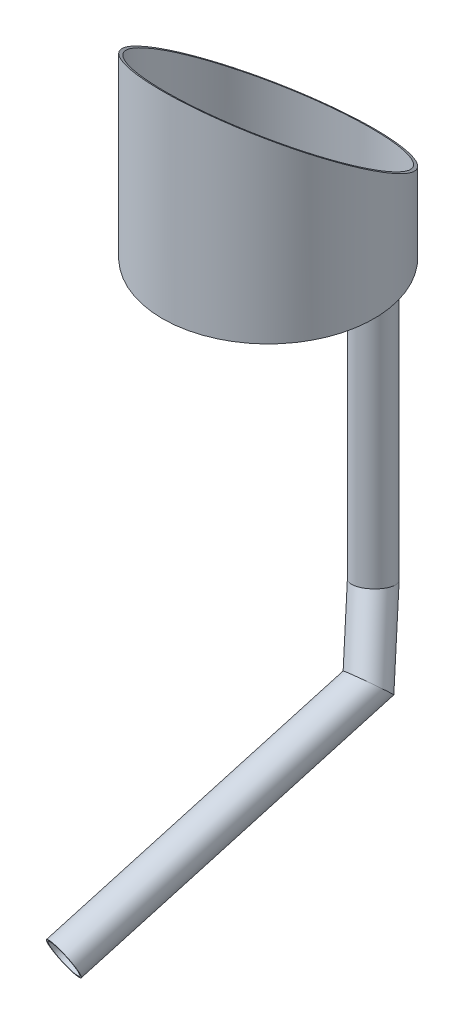
ISO-10303-21;
HEADER;
FILE_DESCRIPTION(('STEP AP214'),'2;1');
FILE_NAME('part.step','',(''),(''),'','','');
FILE_SCHEMA(('AUTOMOTIVE_DESIGN { 1 0 10303 214 1 1 1 1 }'));
ENDSEC;
DATA;
#1=APPLICATION_CONTEXT('core data for automotive mechanical design processes');
#2=APPLICATION_PROTOCOL_DEFINITION('international standard','automotive_design',2000,#1);
#3=PRODUCT_CONTEXT('',#1,'mechanical');
#4=PRODUCT('Part','Part','',(#3));
#5=PRODUCT_RELATED_PRODUCT_CATEGORY('part','',(#4));
#6=PRODUCT_DEFINITION_FORMATION('','',#4);
#7=PRODUCT_DEFINITION_CONTEXT('part definition',#1,'design');
#8=PRODUCT_DEFINITION('design','',#6,#7);
#9=PRODUCT_DEFINITION_SHAPE('','',#8);
#10=(LENGTH_UNIT() NAMED_UNIT(*) SI_UNIT(.MILLI.,.METRE.));
#11=(NAMED_UNIT(*) PLANE_ANGLE_UNIT() SI_UNIT($,.RADIAN.));
#12=(NAMED_UNIT(*) SI_UNIT($,.STERADIAN.) SOLID_ANGLE_UNIT());
#13=UNCERTAINTY_MEASURE_WITH_UNIT(LENGTH_MEASURE(1.E-05),#10,'distance_accuracy_value','');
#14=(GEOMETRIC_REPRESENTATION_CONTEXT(3) GLOBAL_UNCERTAINTY_ASSIGNED_CONTEXT((#13)) GLOBAL_UNIT_ASSIGNED_CONTEXT((#10,
#11,#12)) REPRESENTATION_CONTEXT('',''));
#15=CARTESIAN_POINT('',(0.,0.,0.));
#16=DIRECTION('',(0.,0.,1.));
#17=DIRECTION('',(1.,0.,0.));
#18=AXIS2_PLACEMENT_3D('',#15,#16,#17);
#19=CARTESIAN_POINT('',(40.0000000000001,-304.8,-69.2820323027551));
#20=DIRECTION('',(0.,1.,0.));
#21=DIRECTION('',(0.,0.,1.));
#22=AXIS2_PLACEMENT_3D('',#19,#20,#21);
#23=CYLINDRICAL_SURFACE('',#22,17.399);
#24=CARTESIAN_POINT('',(40.0000000000001,0.,-69.2820323027551));
#25=DIRECTION('',(0.,-1.,0.));
#26=DIRECTION('',(0.,0.,-1.));
#27=AXIS2_PLACEMENT_3D('',#24,#25,#26);
#28=CIRCLE('',#27,17.399);
#29=CARTESIAN_POINT('',(40.0000000000001,0.,-86.681032302755));
#30=VERTEX_POINT('',#29);
#31=EDGE_CURVE('E65',#30,#30,#28,.T.);
#32=ORIENTED_EDGE('',*,*,#31,.F.);
#33=EDGE_LOOP('',(#32));
#34=FACE_BOUND('',#33,.T.);
#35=CARTESIAN_POINT('',(40.0000000000001,-304.8,-69.2820323027551));
#36=DIRECTION('',(0.168834182634602,-0.964595100910073,0.202611228895122));
#37=DIRECTION('',(0.61750037075505,0.263735267456375,0.741037786362538));
#38=AXIS2_PLACEMENT_3D('',#35,#36,#37);
#39=ELLIPSE('',#38,18.0376201201773,17.399);
#40=CARTESIAN_POINT('',(51.1382371117483,-300.042843433329,-55.9154742176505));
#41=VERTEX_POINT('',#40);
#42=EDGE_CURVE('E61',#41,#41,#39,.T.);
#43=ORIENTED_EDGE('',*,*,#42,.T.);
#44=EDGE_LOOP('',(#43));
#45=FACE_BOUND('',#44,.T.);
#46=ADVANCED_FACE('F57',(#34,#45),#23,.F.);
#47=CARTESIAN_POINT('',(40.0000000000001,-304.8,-69.2820323027551));
#48=DIRECTION('',(0.,1.,0.));
#49=DIRECTION('',(0.,0.,1.));
#50=AXIS2_PLACEMENT_3D('',#47,#48,#49);
#51=CYLINDRICAL_SURFACE('',#50,19.05);
#52=CARTESIAN_POINT('',(40.0000000000001,0.,-69.2820323027551));
#53=DIRECTION('',(0.,-1.,0.));
#54=DIRECTION('',(0.,0.,-1.));
#55=AXIS2_PLACEMENT_3D('',#52,#53,#54);
#56=CIRCLE('',#55,19.05);
#57=CARTESIAN_POINT('',(40.0000000000001,0.,-88.3320323027551));
#58=VERTEX_POINT('',#57);
#59=EDGE_CURVE('E69',#58,#58,#56,.T.);
#60=ORIENTED_EDGE('',*,*,#59,.T.);
#61=EDGE_LOOP('',(#60));
#62=FACE_BOUND('',#61,.T.);
#63=CARTESIAN_POINT('',(40.0000000000001,-304.8,-69.2820323027551));
#64=DIRECTION('',(0.168834182634602,-0.964595100910073,0.202611228895122));
#65=DIRECTION('',(0.61750037075505,0.263735267456375,0.741037786362538));
#66=AXIS2_PLACEMENT_3D('',#63,#64,#65);
#67=ELLIPSE('',#66,19.7492191096832,19.05);
#68=CARTESIAN_POINT('',(52.1951501223522,-299.591434416053,-54.6471146913267));
#69=VERTEX_POINT('',#68);
#70=EDGE_CURVE('E12',#69,#69,#67,.T.);
#71=ORIENTED_EDGE('',*,*,#70,.F.);
#72=EDGE_LOOP('',(#71));
#73=FACE_BOUND('',#72,.T.);
#74=ADVANCED_FACE('F84',(#62,#73),#51,.T.);
#75=CARTESIAN_POINT('',(40.0000000000001,0.,-69.2820323027551));
#76=DIRECTION('',(0.,-1.,0.));
#77=DIRECTION('',(0.,0.,-1.));
#78=AXIS2_PLACEMENT_3D('',#75,#76,#77);
#79=PLANE('',#78);
#80=ORIENTED_EDGE('',*,*,#31,.T.);
#81=EDGE_LOOP('',(#80));
#82=FACE_BOUND('',#81,.T.);
#83=ORIENTED_EDGE('',*,*,#59,.F.);
#84=EDGE_LOOP('',(#83));
#85=FACE_BOUND('',#84,.T.);
#86=ADVANCED_FACE('F80',(#82,#85),#79,.F.);
#87=CARTESIAN_POINT('',(40.0000000000001,-304.8,-69.2820323027551));
#88=DIRECTION('',(0.168834182634602,-0.964595100910073,0.202611228895122));
#89=DIRECTION('',(0.,-0.205562183240805,-0.978644056243777));
#90=AXIS2_PLACEMENT_3D('',#87,#88,#89);
#91=PLANE('',#90);
#92=ORIENTED_EDGE('',*,*,#42,.F.);
#93=EDGE_LOOP('',(#92));
#94=FACE_BOUND('',#93,.T.);
#95=ORIENTED_EDGE('',*,*,#70,.T.);
#96=EDGE_LOOP('',(#95));
#97=FACE_BOUND('',#96,.T.);
#98=ADVANCED_FACE('F59',(#94,#97),#91,.T.);
#99=CLOSED_SHELL('',(#46,#74,#86,#98));
#100=MANIFOLD_SOLID_BREP('B2',#99);
#101=CARTESIAN_POINT('',(64.8193497163694,-370.399621205836,-39.4973117684385));
#102=DIRECTION('',(-0.325713250870988,0.860887417399428,-0.390875597563209));
#103=DIRECTION('',(0.,0.413419966091828,0.910540461284742));
#104=AXIS2_PLACEMENT_3D('',#101,#102,#103);
#105=CYLINDRICAL_SURFACE('',#104,17.399);
#106=CARTESIAN_POINT('',(64.8193497163694,-370.399621205836,-39.4973117684385));
#107=DIRECTION('',(0.0828203891155354,-0.724240374652722,0.684555814283712));
#108=DIRECTION('',(-0.629735906835058,0.49435653646272,0.599203056149758));
#109=AXIS2_PLACEMENT_3D('',#106,#107,#108);
#110=ELLIPSE('',#109,18.9523066652852,17.399);
#111=CARTESIAN_POINT('',(52.8844016918899,-361.030424524807,-28.1410316935122));
#112=VERTEX_POINT('',#111);
#113=EDGE_CURVE('E171',#112,#112,#110,.T.);
#114=ORIENTED_EDGE('',*,*,#113,.T.);
#115=EDGE_LOOP('',(#114));
#116=FACE_BOUND('',#115,.T.);
#117=CARTESIAN_POINT('',(40.0000000000001,-304.8,-69.2820323027551));
#118=DIRECTION('',(-0.168834182634602,0.964595100910073,-0.202611228895122));
#119=DIRECTION('',(-0.61750037075505,-0.263735267456376,-0.741037786362537));
#120=AXIS2_PLACEMENT_3D('',#117,#118,#119);
#121=ELLIPSE('',#120,18.0376201201773,17.399);
#122=CARTESIAN_POINT('',(28.8617628882519,-309.557156566671,-82.6485903878596));
#123=VERTEX_POINT('',#122);
#124=EDGE_CURVE('E161',#123,#123,#121,.T.);
#125=ORIENTED_EDGE('',*,*,#124,.T.);
#126=EDGE_LOOP('',(#125));
#127=FACE_BOUND('',#126,.T.);
#128=ADVANCED_FACE('F157',(#116,#127),#105,.F.);
#129=CARTESIAN_POINT('',(64.8193497163694,-370.399621205836,-39.4973117684385));
#130=DIRECTION('',(-0.325713250870988,0.860887417399428,-0.390875597563209));
#131=DIRECTION('',(0.,0.413419966091828,0.910540461284742));
#132=AXIS2_PLACEMENT_3D('',#129,#130,#131);
#133=CYLINDRICAL_SURFACE('',#132,19.05);
#134=CARTESIAN_POINT('',(64.8193497163694,-370.399621205836,-39.4973117684385));
#135=DIRECTION('',(0.0828203891155354,-0.724240374652722,0.684555814283712));
#136=DIRECTION('',(-0.629735906835058,0.49435653646272,0.599203056149758));
#137=AXIS2_PLACEMENT_3D('',#134,#135,#136);
#138=ELLIPSE('',#137,20.7507007284144,19.05);
#139=CARTESIAN_POINT('',(51.7518883756985,-360.141376664563,-27.0634284747236));
#140=VERTEX_POINT('',#139);
#141=EDGE_CURVE('E165',#140,#140,#138,.T.);
#142=ORIENTED_EDGE('',*,*,#141,.F.);
#143=EDGE_LOOP('',(#142));
#144=FACE_BOUND('',#143,.T.);
#145=CARTESIAN_POINT('',(40.0000000000001,-304.8,-69.2820323027551));
#146=DIRECTION('',(-0.168834182634602,0.964595100910073,-0.202611228895122));
#147=DIRECTION('',(-0.61750037075505,-0.263735267456376,-0.741037786362537));
#148=AXIS2_PLACEMENT_3D('',#145,#146,#147);
#149=ELLIPSE('',#148,19.7492191096832,19.05);
#150=CARTESIAN_POINT('',(27.804849877648,-310.008565583947,-83.9169499141834));
#151=VERTEX_POINT('',#150);
#152=EDGE_CURVE('E56',#151,#151,#149,.T.);
#153=ORIENTED_EDGE('',*,*,#152,.F.);
#154=EDGE_LOOP('',(#153));
#155=FACE_BOUND('',#154,.T.);
#156=ADVANCED_FACE('F184',(#144,#155),#133,.T.);
#157=CARTESIAN_POINT('',(64.8193497163694,-370.399621205836,-39.4973117684385));
#158=DIRECTION('',(0.0828203891155354,-0.724240374652722,0.684555814283712));
#159=DIRECTION('',(0.,-0.68691571996482,-0.72673708703025));
#160=AXIS2_PLACEMENT_3D('',#157,#158,#159);
#161=PLANE('',#160);
#162=ORIENTED_EDGE('',*,*,#113,.F.);
#163=EDGE_LOOP('',(#162));
#164=FACE_BOUND('',#163,.T.);
#165=ORIENTED_EDGE('',*,*,#141,.T.);
#166=EDGE_LOOP('',(#165));
#167=FACE_BOUND('',#166,.T.);
#168=ADVANCED_FACE('F180',(#164,#167),#161,.T.);
#169=CARTESIAN_POINT('',(40.0000000000001,-304.8,-69.2820323027551));
#170=DIRECTION('',(-0.168834182634602,0.964595100910073,-0.202611228895122));
#171=DIRECTION('',(0.,0.205562183240805,0.978644056243777));
#172=AXIS2_PLACEMENT_3D('',#169,#170,#171);
#173=PLANE('',#172);
#174=ORIENTED_EDGE('',*,*,#124,.F.);
#175=EDGE_LOOP('',(#174));
#176=FACE_BOUND('',#175,.T.);
#177=ORIENTED_EDGE('',*,*,#152,.T.);
#178=EDGE_LOOP('',(#177));
#179=FACE_BOUND('',#178,.T.);
#180=ADVANCED_FACE('F159',(#176,#179),#173,.T.);
#181=CLOSED_SHELL('',(#128,#156,#168,#180));
#182=MANIFOLD_SOLID_BREP('B7',#181);
#183=CARTESIAN_POINT('',(11.89138516349,-513.313548337832,224.467231305058));
#184=DIRECTION('',(0.173648177666927,0.468877713687648,-0.866025403784438));
#185=DIRECTION('',(0.,0.879385241571816,0.476110908198583));
#186=AXIS2_PLACEMENT_3D('',#183,#184,#185);
#187=CYLINDRICAL_SURFACE('',#186,17.399);
#188=CARTESIAN_POINT('',(11.89138516349,-513.313548337832,224.467231305058));
#189=DIRECTION('',(-0.173648177666927,-0.468877713687648,0.866025403784438));
#190=DIRECTION('',(0.124666664348634,-0.882776630992003,-0.452949933849861));
#191=AXIS2_PLACEMENT_3D('',#188,#189,#190);
#192=CIRCLE('',#191,17.399);
#193=CARTESIAN_POINT('',(14.0604604564919,-528.672978940462,216.586355406004));
#194=VERTEX_POINT('',#193);
#195=EDGE_CURVE('E274',#194,#194,#192,.T.);
#196=ORIENTED_EDGE('',*,*,#195,.T.);
#197=EDGE_LOOP('',(#196));
#198=FACE_BOUND('',#197,.T.);
#199=CARTESIAN_POINT('',(64.8193497163694,-370.399621205836,-39.4973117684385));
#200=DIRECTION('',(-0.0828203891155353,0.724240374652722,-0.684555814283712));
#201=DIRECTION('',(0.629735906835058,-0.49435653646272,-0.599203056149758));
#202=AXIS2_PLACEMENT_3D('',#199,#200,#201);
#203=ELLIPSE('',#202,18.9523066652852,17.399);
#204=CARTESIAN_POINT('',(76.7542977408489,-379.768817886866,-50.8535918433649));
#205=VERTEX_POINT('',#204);
#206=EDGE_CURVE('E264',#205,#205,#203,.T.);
#207=ORIENTED_EDGE('',*,*,#206,.T.);
#208=EDGE_LOOP('',(#207));
#209=FACE_BOUND('',#208,.T.);
#210=ADVANCED_FACE('F260',(#198,#209),#187,.F.);
#211=CARTESIAN_POINT('',(11.89138516349,-513.313548337832,224.467231305058));
#212=DIRECTION('',(0.173648177666927,0.468877713687648,-0.866025403784438));
#213=DIRECTION('',(0.,0.879385241571816,0.476110908198583));
#214=AXIS2_PLACEMENT_3D('',#211,#212,#213);
#215=CYLINDRICAL_SURFACE('',#214,19.05);
#216=CARTESIAN_POINT('',(11.89138516349,-513.313548337832,224.467231305058));
#217=DIRECTION('',(-0.173648177666927,-0.468877713687648,0.866025403784438));
#218=DIRECTION('',(0.124666664348634,-0.882776630992003,-0.452949933849861));
#219=AXIS2_PLACEMENT_3D('',#216,#217,#218);
#220=CIRCLE('',#219,19.05);
#221=CARTESIAN_POINT('',(14.2662851193315,-530.130443158229,215.838535065218));
#222=VERTEX_POINT('',#221);
#223=EDGE_CURVE('E268',#222,#222,#220,.T.);
#224=ORIENTED_EDGE('',*,*,#223,.F.);
#225=EDGE_LOOP('',(#224));
#226=FACE_BOUND('',#225,.T.);
#227=CARTESIAN_POINT('',(64.8193497163694,-370.399621205836,-39.4973117684385));
#228=DIRECTION('',(-0.0828203891155353,0.724240374652722,-0.684555814283712));
#229=DIRECTION('',(0.629735906835058,-0.49435653646272,-0.599203056149758));
#230=AXIS2_PLACEMENT_3D('',#227,#228,#229);
#231=ELLIPSE('',#230,20.7507007284144,19.05);
#232=CARTESIAN_POINT('',(77.8868110570404,-380.65786574711,-51.9311950621535));
#233=VERTEX_POINT('',#232);
#234=EDGE_CURVE('E156',#233,#233,#231,.T.);
#235=ORIENTED_EDGE('',*,*,#234,.F.);
#236=EDGE_LOOP('',(#235));
#237=FACE_BOUND('',#236,.T.);
#238=ADVANCED_FACE('F287',(#226,#237),#215,.T.);
#239=CARTESIAN_POINT('',(11.89138516349,-513.313548337832,224.467231305058));
#240=DIRECTION('',(-0.173648177666927,-0.468877713687648,0.866025403784438));
#241=DIRECTION('',(0.124666664348634,-0.882776630992003,-0.452949933849861));
#242=AXIS2_PLACEMENT_3D('',#239,#240,#241);
#243=PLANE('',#242);
#244=ORIENTED_EDGE('',*,*,#195,.F.);
#245=EDGE_LOOP('',(#244));
#246=FACE_BOUND('',#245,.T.);
#247=ORIENTED_EDGE('',*,*,#223,.T.);
#248=EDGE_LOOP('',(#247));
#249=FACE_BOUND('',#248,.T.);
#250=ADVANCED_FACE('F283',(#246,#249),#243,.T.);
#251=CARTESIAN_POINT('',(64.8193497163694,-370.399621205836,-39.4973117684385));
#252=DIRECTION('',(-0.0828203891155353,0.724240374652722,-0.684555814283712));
#253=DIRECTION('',(0.,0.68691571996482,0.72673708703025));
#254=AXIS2_PLACEMENT_3D('',#251,#252,#253);
#255=PLANE('',#254);
#256=ORIENTED_EDGE('',*,*,#206,.F.);
#257=EDGE_LOOP('',(#256));
#258=FACE_BOUND('',#257,.T.);
#259=ORIENTED_EDGE('',*,*,#234,.T.);
#260=EDGE_LOOP('',(#259));
#261=FACE_BOUND('',#260,.T.);
#262=ADVANCED_FACE('F262',(#258,#261),#255,.T.);
#263=CLOSED_SHELL('',(#210,#238,#250,#262));
#264=MANIFOLD_SOLID_BREP('B51',#263);
#265=CARTESIAN_POINT('',(0.,0.,0.));
#266=DIRECTION('',(0.,1.,0.));
#267=DIRECTION('',(0.,0.,1.));
#268=AXIS2_PLACEMENT_3D('',#265,#266,#267);
#269=PLANE('',#268);
#270=CARTESIAN_POINT('',(0.,0.,0.));
#271=DIRECTION('',(0.,1.,0.));
#272=DIRECTION('',(0.,0.,1.));
#273=AXIS2_PLACEMENT_3D('',#270,#271,#272);
#274=CIRCLE('',#273,8.);
#275=CARTESIAN_POINT('',(0.,0.,8.));
#276=VERTEX_POINT('',#275);
#277=EDGE_CURVE('E451',#276,#276,#274,.T.);
#278=ORIENTED_EDGE('',*,*,#277,.T.);
#279=EDGE_LOOP('',(#278));
#280=FACE_BOUND('',#279,.T.);
#281=CARTESIAN_POINT('',(0.,0.,0.));
#282=DIRECTION('',(0.,-1.,0.));
#283=DIRECTION('',(0.,0.,-1.));
#284=AXIS2_PLACEMENT_3D('',#281,#282,#283);
#285=CIRCLE('',#284,15.);
#286=CARTESIAN_POINT('',(0.,0.,-15.));
#287=VERTEX_POINT('',#286);
#288=EDGE_CURVE('E431',#287,#287,#285,.T.);
#289=ORIENTED_EDGE('',*,*,#288,.T.);
#290=EDGE_LOOP('',(#289));
#291=FACE_BOUND('',#290,.T.);
#292=ADVANCED_FACE('F352',(#280,#291),#269,.F.);
#293=CARTESIAN_POINT('',(0.,5.,0.));
#294=DIRECTION('',(0.,-1.,0.));
#295=DIRECTION('',(0.,0.,-1.));
#296=AXIS2_PLACEMENT_3D('',#293,#294,#295);
#297=CYLINDRICAL_SURFACE('',#296,110.);
#298=CARTESIAN_POINT('',(0.,0.,0.));
#299=DIRECTION('',(0.,1.,0.));
#300=DIRECTION('',(0.,0.,1.));
#301=AXIS2_PLACEMENT_3D('',#298,#299,#300);
#302=CIRCLE('',#301,110.);
#303=CARTESIAN_POINT('',(0.,0.,110.));
#304=VERTEX_POINT('',#303);
#305=EDGE_CURVE('E456',#304,#304,#302,.T.);
#306=ORIENTED_EDGE('',*,*,#305,.T.);
#307=EDGE_LOOP('',(#306));
#308=FACE_BOUND('',#307,.T.);
#309=CARTESIAN_POINT('',(0.,133.143230473068,0.));
#310=DIRECTION('',(0.,-0.837200689271595,0.546895790697978));
#311=DIRECTION('',(0.,-0.546895790697978,-0.837200689271595));
#312=AXIS2_PLACEMENT_3D('',#309,#310,#311);
#313=ELLIPSE('',#312,131.390240607309,110.);
#314=CARTESIAN_POINT('',(0.,61.2864609461361,-110.));
#315=VERTEX_POINT('',#314);
#316=EDGE_CURVE('E444',#315,#315,#313,.T.);
#317=ORIENTED_EDGE('',*,*,#316,.T.);
#318=EDGE_LOOP('',(#317));
#319=FACE_BOUND('',#318,.T.);
#320=ADVANCED_FACE('F354',(#308,#319),#297,.T.);
#321=CARTESIAN_POINT('',(0.,5.,0.));
#322=DIRECTION('',(0.,1.,0.));
#323=DIRECTION('',(0.,0.,1.));
#324=AXIS2_PLACEMENT_3D('',#321,#322,#323);
#325=PLANE('',#324);
#326=DIRECTION('',(-1.,0.,0.));
#327=VECTOR('',#326,1.);
#328=CARTESIAN_POINT('',(0.,5.,-65.6199999987334));
#329=LINE('',#328,#327);
#330=CARTESIAN_POINT('',(47.4650744848068,5.,-65.6199999987334));
#331=VERTEX_POINT('',#330);
#332=CARTESIAN_POINT('',(46.5451905552324,5.,-65.6199999987334));
#333=VERTEX_POINT('',#332);
#334=EDGE_CURVE('E426',#331,#333,#329,.T.);
#335=ORIENTED_EDGE('',*,*,#334,.F.);
#336=DIRECTION('',(0.,0.,-1.));
#337=VECTOR('',#336,1.);
#338=CARTESIAN_POINT('',(47.4650744848068,5.,0.));
#339=LINE('',#338,#337);
#340=CARTESIAN_POINT('',(47.4650744848068,5.,-62.323345104488));
#341=VERTEX_POINT('',#340);
#342=EDGE_CURVE('E429',#341,#331,#339,.T.);
#343=ORIENTED_EDGE('',*,*,#342,.F.);
#344=DIRECTION('',(1.,0.,0.));
#345=VECTOR('',#344,1.);
#346=CARTESIAN_POINT('',(0.,5.,-62.323345104488));
#347=LINE('',#346,#345);
#348=CARTESIAN_POINT('',(43.1273906321388,5.,-62.323345104488));
#349=VERTEX_POINT('',#348);
#350=EDGE_CURVE('E375',#349,#341,#347,.T.);
#351=ORIENTED_EDGE('',*,*,#350,.F.);
#352=DIRECTION('',(0.,0.,1.));
#353=VECTOR('',#352,1.);
#354=CARTESIAN_POINT('',(43.1273906321388,5.,0.));
#355=LINE('',#354,#353);
#356=CARTESIAN_POINT('',(43.1273906321388,5.,-62.4651834828082));
#357=VERTEX_POINT('',#356);
#358=EDGE_CURVE('E423',#357,#349,#355,.T.);
#359=ORIENTED_EDGE('',*,*,#358,.F.);
#360=CARTESIAN_POINT('',(40.0000000000001,5.,-69.2820323027551));
#361=DIRECTION('',(0.,1.,0.));
#362=DIRECTION('',(0.,0.,1.));
#363=AXIS2_PLACEMENT_3D('',#360,#361,#362);
#364=CIRCLE('',#363,7.50000000000001);
#365=EDGE_CURVE('E448',#333,#357,#364,.T.);
#366=ORIENTED_EDGE('',*,*,#365,.F.);
#367=EDGE_LOOP('',(#335,#343,#351,#359,#366));
#368=FACE_BOUND('',#367,.T.);
#369=CARTESIAN_POINT('',(0.,5.,0.));
#370=DIRECTION('',(0.,1.,0.));
#371=DIRECTION('',(0.,0.,1.));
#372=AXIS2_PLACEMENT_3D('',#369,#370,#371);
#373=CIRCLE('',#372,8.);
#374=CARTESIAN_POINT('',(0.,5.,8.));
#375=VERTEX_POINT('',#374);
#376=EDGE_CURVE('E453',#375,#375,#373,.T.);
#377=ORIENTED_EDGE('',*,*,#376,.F.);
#378=EDGE_LOOP('',(#377));
#379=FACE_BOUND('',#378,.T.);
#380=CARTESIAN_POINT('',(0.,5.,0.));
#381=DIRECTION('',(0.,1.,0.));
#382=DIRECTION('',(0.,0.,1.));
#383=AXIS2_PLACEMENT_3D('',#380,#381,#382);
#384=CIRCLE('',#383,107.);
#385=CARTESIAN_POINT('',(0.,5.,107.));
#386=VERTEX_POINT('',#385);
#387=EDGE_CURVE('E461',#386,#386,#384,.F.);
#388=ORIENTED_EDGE('',*,*,#387,.F.);
#389=EDGE_LOOP('',(#388));
#390=FACE_BOUND('',#389,.T.);
#391=ADVANCED_FACE('F478',(#368,#379,#390),#325,.T.);
#392=CARTESIAN_POINT('',(0.,0.,0.));
#393=DIRECTION('',(0.,1.,0.));
#394=DIRECTION('',(0.,0.,1.));
#395=AXIS2_PLACEMENT_3D('',#392,#393,#394);
#396=CIRCLE('',#395,25.);
#397=CARTESIAN_POINT('',(0.,0.,25.));
#398=VERTEX_POINT('',#397);
#399=EDGE_CURVE('E464',#398,#398,#396,.F.);
#400=ORIENTED_EDGE('',*,*,#399,.F.);
#401=EDGE_LOOP('',(#400));
#402=FACE_BOUND('',#401,.T.);
#403=ORIENTED_EDGE('',*,*,#305,.F.);
#404=EDGE_LOOP('',(#403));
#405=FACE_BOUND('',#404,.T.);
#406=DIRECTION('',(0.,0.,1.));
#407=VECTOR('',#406,1.);
#408=CARTESIAN_POINT('',(47.4650744848068,0.,-62.323345104488));
#409=LINE('',#408,#407);
#410=CARTESIAN_POINT('',(47.4650744848068,0.,-65.6199999987334));
#411=VERTEX_POINT('',#410);
#412=CARTESIAN_POINT('',(47.4650744848068,0.,-62.323345104488));
#413=VERTEX_POINT('',#412);
#414=EDGE_CURVE('E408',#411,#413,#409,.T.);
#415=ORIENTED_EDGE('',*,*,#414,.F.);
#416=DIRECTION('',(1.,0.,0.));
#417=VECTOR('',#416,1.);
#418=CARTESIAN_POINT('',(43.1273906321388,0.,-65.6199999987334));
#419=LINE('',#418,#417);
#420=CARTESIAN_POINT('',(46.5451905552324,0.,-65.6199999987334));
#421=VERTEX_POINT('',#420);
#422=EDGE_CURVE('E405',#421,#411,#419,.T.);
#423=ORIENTED_EDGE('',*,*,#422,.F.);
#424=CARTESIAN_POINT('',(40.0000000000001,0.,-69.2820323027551));
#425=DIRECTION('',(0.,1.,0.));
#426=DIRECTION('',(0.,0.,1.));
#427=AXIS2_PLACEMENT_3D('',#424,#425,#426);
#428=CIRCLE('',#427,7.50000000000001);
#429=CARTESIAN_POINT('',(43.1273906321388,0.,-62.4651834828082));
#430=VERTEX_POINT('',#429);
#431=EDGE_CURVE('E447',#421,#430,#428,.T.);
#432=ORIENTED_EDGE('',*,*,#431,.T.);
#433=DIRECTION('',(0.,0.,-1.));
#434=VECTOR('',#433,1.);
#435=CARTESIAN_POINT('',(43.1273906321388,0.,-62.323345104488));
#436=LINE('',#435,#434);
#437=CARTESIAN_POINT('',(43.1273906321388,0.,-62.323345104488));
#438=VERTEX_POINT('',#437);
#439=EDGE_CURVE('E367',#438,#430,#436,.T.);
#440=ORIENTED_EDGE('',*,*,#439,.F.);
#441=DIRECTION('',(-1.,0.,0.));
#442=VECTOR('',#441,1.);
#443=CARTESIAN_POINT('',(43.1273906321388,0.,-62.323345104488));
#444=LINE('',#443,#442);
#445=EDGE_CURVE('E401',#413,#438,#444,.T.);
#446=ORIENTED_EDGE('',*,*,#445,.F.);
#447=EDGE_LOOP('',(#415,#423,#432,#440,#446));
#448=FACE_BOUND('',#447,.T.);
#449=ADVANCED_FACE('F416',(#402,#405,#448),#269,.F.);
#450=CARTESIAN_POINT('',(0.,5.,0.));
#451=DIRECTION('',(0.,-1.,0.));
#452=DIRECTION('',(0.,0.,-1.));
#453=AXIS2_PLACEMENT_3D('',#450,#451,#452);
#454=CYLINDRICAL_SURFACE('',#453,8.);
#455=ORIENTED_EDGE('',*,*,#376,.T.);
#456=EDGE_LOOP('',(#455));
#457=FACE_BOUND('',#456,.T.);
#458=ORIENTED_EDGE('',*,*,#277,.F.);
#459=EDGE_LOOP('',(#458));
#460=FACE_BOUND('',#459,.T.);
#461=ADVANCED_FACE('F502',(#457,#460),#454,.F.);
#462=CARTESIAN_POINT('',(40.0000000000001,5.,-69.2820323027551));
#463=DIRECTION('',(0.,-1.,0.));
#464=DIRECTION('',(0.,0.,-1.));
#465=AXIS2_PLACEMENT_3D('',#462,#463,#464);
#466=CYLINDRICAL_SURFACE('',#465,7.50000000000001);
#467=DIRECTION('',(0.,-1.,0.));
#468=VECTOR('',#467,1.);
#469=CARTESIAN_POINT('',(46.5451905552324,5.,-65.6199999987334));
#470=LINE('',#469,#468);
#471=EDGE_CURVE('E258',#333,#421,#470,.T.);
#472=ORIENTED_EDGE('',*,*,#471,.F.);
#473=ORIENTED_EDGE('',*,*,#365,.T.);
#474=DIRECTION('',(0.,-1.,0.));
#475=VECTOR('',#474,1.);
#476=CARTESIAN_POINT('',(43.1273906321388,5.,-62.4651834828082));
#477=LINE('',#476,#475);
#478=EDGE_CURVE('E360',#430,#357,#477,.F.);
#479=ORIENTED_EDGE('',*,*,#478,.F.);
#480=ORIENTED_EDGE('',*,*,#431,.F.);
#481=EDGE_LOOP('',(#472,#473,#479,#480));
#482=FACE_BOUND('',#481,.T.);
#483=ADVANCED_FACE('F481',(#482),#466,.F.);
#484=CARTESIAN_POINT('',(0.,205.,0.));
#485=DIRECTION('',(0.,-1.,0.));
#486=DIRECTION('',(0.,0.,-1.));
#487=AXIS2_PLACEMENT_3D('',#484,#485,#486);
#488=CYLINDRICAL_SURFACE('',#487,107.);
#489=CARTESIAN_POINT('',(0.,133.143230473068,0.));
#490=DIRECTION('',(0.,-0.837200689271595,0.546895790697978));
#491=DIRECTION('',(0.,-0.546895790697978,-0.837200689271595));
#492=AXIS2_PLACEMENT_3D('',#489,#490,#491);
#493=ELLIPSE('',#492,127.806870408928,107.);
#494=CARTESIAN_POINT('',(0.,63.2461910241434,-107.));
#495=VERTEX_POINT('',#494);
#496=EDGE_CURVE('E443',#495,#495,#493,.T.);
#497=ORIENTED_EDGE('',*,*,#496,.F.);
#498=EDGE_LOOP('',(#497));
#499=FACE_BOUND('',#498,.T.);
#500=ORIENTED_EDGE('',*,*,#387,.T.);
#501=EDGE_LOOP('',(#500));
#502=FACE_BOUND('',#501,.T.);
#503=ADVANCED_FACE('F519',(#499,#502),#488,.F.);
#504=CARTESIAN_POINT('',(-110.,205.,110.));
#505=DIRECTION('',(0.,-0.837200689271595,0.546895790697978));
#506=DIRECTION('',(0.,-0.546895790697978,-0.837200689271595));
#507=AXIS2_PLACEMENT_3D('',#504,#505,#506);
#508=PLANE('',#507);
#509=ORIENTED_EDGE('',*,*,#496,.T.);
#510=EDGE_LOOP('',(#509));
#511=FACE_BOUND('',#510,.T.);
#512=ORIENTED_EDGE('',*,*,#316,.F.);
#513=EDGE_LOOP('',(#512));
#514=FACE_BOUND('',#513,.T.);
#515=ADVANCED_FACE('F516',(#511,#514),#508,.F.);
#516=CARTESIAN_POINT('',(0.,-25.,0.));
#517=DIRECTION('',(0.,-1.,0.));
#518=DIRECTION('',(0.,0.,-1.));
#519=AXIS2_PLACEMENT_3D('',#516,#517,#518);
#520=PLANE('',#519);
#521=CARTESIAN_POINT('',(0.,-25.,0.));
#522=DIRECTION('',(0.,-1.,0.));
#523=DIRECTION('',(0.,0.,-1.));
#524=AXIS2_PLACEMENT_3D('',#521,#522,#523);
#525=CIRCLE('',#524,25.);
#526=CARTESIAN_POINT('',(0.,-25.,-25.));
#527=VERTEX_POINT('',#526);
#528=EDGE_CURVE('E440',#527,#527,#525,.T.);
#529=ORIENTED_EDGE('',*,*,#528,.T.);
#530=EDGE_LOOP('',(#529));
#531=FACE_BOUND('',#530,.T.);
#532=CARTESIAN_POINT('',(0.,-25.,0.));
#533=DIRECTION('',(0.,-1.,0.));
#534=DIRECTION('',(0.,0.,-1.));
#535=AXIS2_PLACEMENT_3D('',#532,#533,#534);
#536=CIRCLE('',#535,17.5);
#537=CARTESIAN_POINT('',(0.,-25.,-17.5));
#538=VERTEX_POINT('',#537);
#539=EDGE_CURVE('E435',#538,#538,#536,.T.);
#540=ORIENTED_EDGE('',*,*,#539,.F.);
#541=EDGE_LOOP('',(#540));
#542=FACE_BOUND('',#541,.T.);
#543=ADVANCED_FACE('F518',(#531,#542),#520,.T.);
#544=CARTESIAN_POINT('',(0.,-25.,0.));
#545=DIRECTION('',(0.,1.,0.));
#546=DIRECTION('',(0.,0.,1.));
#547=AXIS2_PLACEMENT_3D('',#544,#545,#546);
#548=CYLINDRICAL_SURFACE('',#547,25.);
#549=ORIENTED_EDGE('',*,*,#528,.F.);
#550=EDGE_LOOP('',(#549));
#551=FACE_BOUND('',#550,.T.);
#552=ORIENTED_EDGE('',*,*,#399,.T.);
#553=EDGE_LOOP('',(#552));
#554=FACE_BOUND('',#553,.T.);
#555=ADVANCED_FACE('F526',(#551,#554),#548,.T.);
#556=CARTESIAN_POINT('',(0.,-25.,0.));
#557=DIRECTION('',(0.,1.,0.));
#558=DIRECTION('',(0.,0.,1.));
#559=AXIS2_PLACEMENT_3D('',#556,#557,#558);
#560=CYLINDRICAL_SURFACE('',#559,17.5);
#561=CARTESIAN_POINT('',(0.,-14.,0.));
#562=DIRECTION('',(0.,-1.,0.));
#563=DIRECTION('',(0.,0.,-1.));
#564=AXIS2_PLACEMENT_3D('',#561,#562,#563);
#565=CIRCLE('',#564,17.5);
#566=CARTESIAN_POINT('',(0.,-14.,-17.5));
#567=VERTEX_POINT('',#566);
#568=EDGE_CURVE('E469',#567,#567,#565,.T.);
#569=ORIENTED_EDGE('',*,*,#568,.F.);
#570=EDGE_LOOP('',(#569));
#571=FACE_BOUND('',#570,.T.);
#572=ORIENTED_EDGE('',*,*,#539,.T.);
#573=EDGE_LOOP('',(#572));
#574=FACE_BOUND('',#573,.T.);
#575=ADVANCED_FACE('F570',(#571,#574),#560,.F.);
#576=CARTESIAN_POINT('',(0.,-14.,0.));
#577=DIRECTION('',(0.,-1.,0.));
#578=DIRECTION('',(0.,0.,-1.));
#579=AXIS2_PLACEMENT_3D('',#576,#577,#578);
#580=PLANE('',#579);
#581=ORIENTED_EDGE('',*,*,#568,.T.);
#582=EDGE_LOOP('',(#581));
#583=FACE_BOUND('',#582,.T.);
#584=CARTESIAN_POINT('',(0.,-14.,0.));
#585=DIRECTION('',(0.,-1.,0.));
#586=DIRECTION('',(0.,0.,-1.));
#587=AXIS2_PLACEMENT_3D('',#584,#585,#586);
#588=CIRCLE('',#587,15.);
#589=CARTESIAN_POINT('',(0.,-14.,-15.));
#590=VERTEX_POINT('',#589);
#591=EDGE_CURVE('E432',#590,#590,#588,.T.);
#592=ORIENTED_EDGE('',*,*,#591,.F.);
#593=EDGE_LOOP('',(#592));
#594=FACE_BOUND('',#593,.T.);
#595=ADVANCED_FACE('F587',(#583,#594),#580,.T.);
#596=CARTESIAN_POINT('',(0.,-14.,0.));
#597=DIRECTION('',(0.,1.,0.));
#598=DIRECTION('',(0.,0.,1.));
#599=AXIS2_PLACEMENT_3D('',#596,#597,#598);
#600=CYLINDRICAL_SURFACE('',#599,15.);
#601=ORIENTED_EDGE('',*,*,#591,.T.);
#602=EDGE_LOOP('',(#601));
#603=FACE_BOUND('',#602,.T.);
#604=ORIENTED_EDGE('',*,*,#288,.F.);
#605=EDGE_LOOP('',(#604));
#606=FACE_BOUND('',#605,.T.);
#607=ADVANCED_FACE('F491',(#603,#606),#600,.F.);
#608=CARTESIAN_POINT('',(47.4650744848068,10.,-62.323345104488));
#609=DIRECTION('',(1.,0.,0.));
#610=DIRECTION('',(0.,0.,-1.));
#611=AXIS2_PLACEMENT_3D('',#608,#609,#610);
#612=PLANE('',#611);
#613=ORIENTED_EDGE('',*,*,#342,.T.);
#614=DIRECTION('',(0.,-1.,0.));
#615=VECTOR('',#614,1.);
#616=CARTESIAN_POINT('',(47.4650744848068,10.,-65.6199999987334));
#617=LINE('',#616,#615);
#618=EDGE_CURVE('E411',#331,#411,#617,.T.);
#619=ORIENTED_EDGE('',*,*,#618,.T.);
#620=ORIENTED_EDGE('',*,*,#414,.T.);
#621=DIRECTION('',(0.,-1.,0.));
#622=VECTOR('',#621,1.);
#623=CARTESIAN_POINT('',(47.4650744848068,10.,-62.323345104488));
#624=LINE('',#623,#622);
#625=EDGE_CURVE('E397',#341,#413,#624,.T.);
#626=ORIENTED_EDGE('',*,*,#625,.F.);
#627=EDGE_LOOP('',(#613,#619,#620,#626));
#628=FACE_BOUND('',#627,.T.);
#629=ADVANCED_FACE('F409',(#628),#612,.F.);
#630=CARTESIAN_POINT('',(43.1273906321388,10.,-65.6199999987334));
#631=DIRECTION('',(0.,0.,-1.));
#632=DIRECTION('',(-1.,0.,0.));
#633=AXIS2_PLACEMENT_3D('',#630,#631,#632);
#634=PLANE('',#633);
#635=ORIENTED_EDGE('',*,*,#334,.T.);
#636=ORIENTED_EDGE('',*,*,#471,.T.);
#637=ORIENTED_EDGE('',*,*,#422,.T.);
#638=ORIENTED_EDGE('',*,*,#618,.F.);
#639=EDGE_LOOP('',(#635,#636,#637,#638));
#640=FACE_BOUND('',#639,.T.);
#641=ADVANCED_FACE('F483',(#640),#634,.F.);
#642=CARTESIAN_POINT('',(43.1273906321388,10.,-62.323345104488));
#643=DIRECTION('',(-1.,0.,0.));
#644=DIRECTION('',(0.,0.,1.));
#645=AXIS2_PLACEMENT_3D('',#642,#643,#644);
#646=PLANE('',#645);
#647=ORIENTED_EDGE('',*,*,#358,.T.);
#648=DIRECTION('',(0.,-1.,0.));
#649=VECTOR('',#648,1.);
#650=CARTESIAN_POINT('',(43.1273906321388,10.,-62.323345104488));
#651=LINE('',#650,#649);
#652=EDGE_CURVE('E404',#349,#438,#651,.T.);
#653=ORIENTED_EDGE('',*,*,#652,.T.);
#654=ORIENTED_EDGE('',*,*,#439,.T.);
#655=ORIENTED_EDGE('',*,*,#478,.T.);
#656=EDGE_LOOP('',(#647,#653,#654,#655));
#657=FACE_BOUND('',#656,.T.);
#658=ADVANCED_FACE('F472',(#657),#646,.F.);
#659=CARTESIAN_POINT('',(43.1273906321388,10.,-62.323345104488));
#660=DIRECTION('',(0.,0.,1.));
#661=DIRECTION('',(1.,0.,0.));
#662=AXIS2_PLACEMENT_3D('',#659,#660,#661);
#663=PLANE('',#662);
#664=ORIENTED_EDGE('',*,*,#350,.T.);
#665=ORIENTED_EDGE('',*,*,#625,.T.);
#666=ORIENTED_EDGE('',*,*,#445,.T.);
#667=ORIENTED_EDGE('',*,*,#652,.F.);
#668=EDGE_LOOP('',(#664,#665,#666,#667));
#669=FACE_BOUND('',#668,.T.);
#670=ADVANCED_FACE('F399',(#669),#663,.F.);
#671=CLOSED_SHELL('',(#292,#320,#391,#449,#461,#483,#503,#515,#543,#555,#575,#595,#607,#629,
#641,#658,#670));
#672=MANIFOLD_SOLID_BREP('B151',#671);
#673=ADVANCED_BREP_SHAPE_REPRESENTATION('',(#18,#100,#182,#264,#672),#14);
#674=SHAPE_DEFINITION_REPRESENTATION(#9,#673);
ENDSEC;
END-ISO-10303-21;
